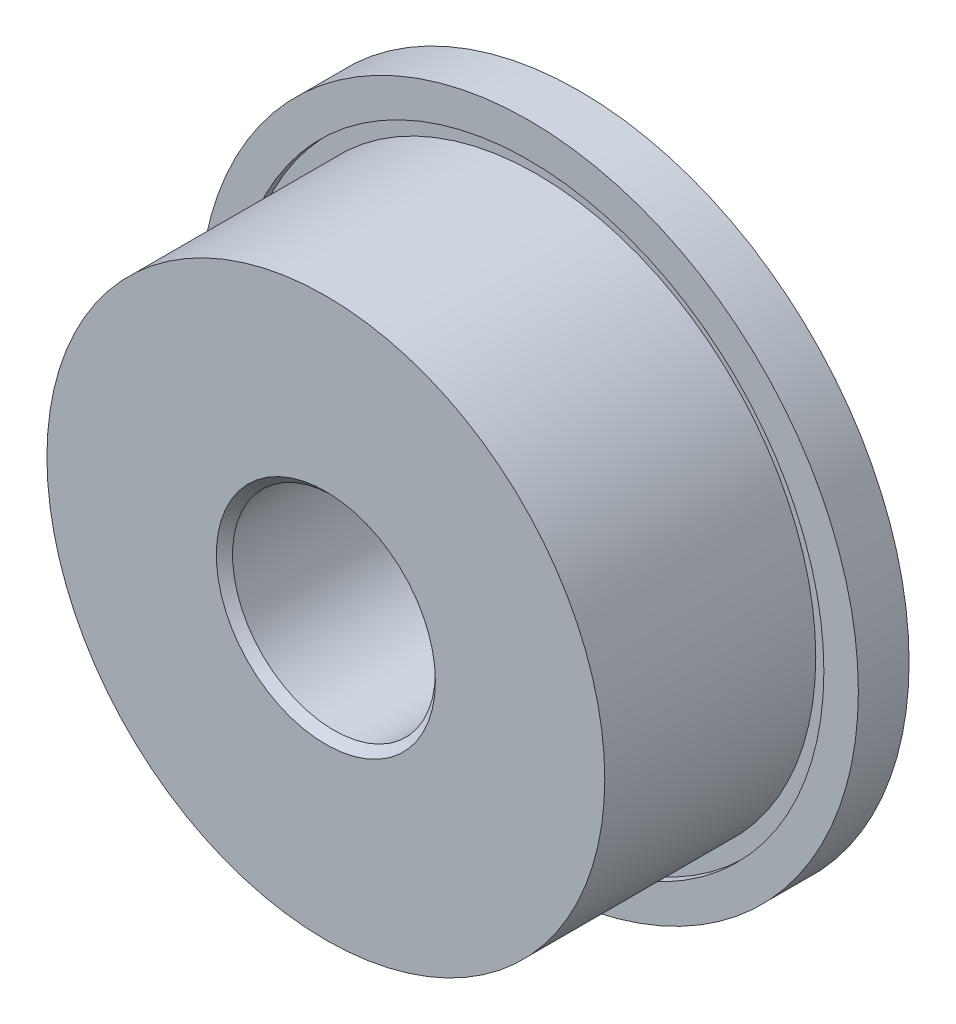
ISO-10303-21;
HEADER;
FILE_DESCRIPTION(('STEP AP214'),'2;1');
FILE_NAME('part.step','',(''),(''),'','','');
FILE_SCHEMA(('AUTOMOTIVE_DESIGN { 1 0 10303 214 1 1 1 1 }'));
ENDSEC;
DATA;
#1=APPLICATION_CONTEXT('core data for automotive mechanical design processes');
#2=APPLICATION_PROTOCOL_DEFINITION('international standard','automotive_design',2000,#1);
#3=PRODUCT_CONTEXT('',#1,'mechanical');
#4=PRODUCT('Part','Part','',(#3));
#5=PRODUCT_RELATED_PRODUCT_CATEGORY('part','',(#4));
#6=PRODUCT_DEFINITION_FORMATION('','',#4);
#7=PRODUCT_DEFINITION_CONTEXT('part definition',#1,'design');
#8=PRODUCT_DEFINITION('design','',#6,#7);
#9=PRODUCT_DEFINITION_SHAPE('','',#8);
#10=(LENGTH_UNIT() NAMED_UNIT(*) SI_UNIT(.MILLI.,.METRE.));
#11=(NAMED_UNIT(*) PLANE_ANGLE_UNIT() SI_UNIT($,.RADIAN.));
#12=(NAMED_UNIT(*) SI_UNIT($,.STERADIAN.) SOLID_ANGLE_UNIT());
#13=UNCERTAINTY_MEASURE_WITH_UNIT(LENGTH_MEASURE(1.E-05),#10,'distance_accuracy_value','');
#14=(GEOMETRIC_REPRESENTATION_CONTEXT(3) GLOBAL_UNCERTAINTY_ASSIGNED_CONTEXT((#13)) GLOBAL_UNIT_ASSIGNED_CONTEXT((#10,
#11,#12)) REPRESENTATION_CONTEXT('',''));
#15=CARTESIAN_POINT('',(0.,0.,0.));
#16=DIRECTION('',(0.,0.,1.));
#17=DIRECTION('',(1.,0.,0.));
#18=AXIS2_PLACEMENT_3D('',#15,#16,#17);
#19=CARTESIAN_POINT('',(0.,0.,1.5875));
#20=DIRECTION('',(0.,0.,-1.));
#21=DIRECTION('',(-1.,0.,0.));
#22=AXIS2_PLACEMENT_3D('',#19,#20,#21);
#23=CYLINDRICAL_SURFACE('',#22,10.31875);
#24=CARTESIAN_POINT('',(0.,0.,1.5875));
#25=DIRECTION('',(0.,0.,1.));
#26=DIRECTION('',(1.,0.,0.));
#27=AXIS2_PLACEMENT_3D('',#24,#25,#26);
#28=CIRCLE('',#27,10.31875);
#29=CARTESIAN_POINT('',(10.31875,0.,1.5875));
#30=VERTEX_POINT('',#29);
#31=EDGE_CURVE('E58',#30,#30,#28,.T.);
#32=ORIENTED_EDGE('',*,*,#31,.F.);
#33=EDGE_LOOP('',(#32));
#34=FACE_BOUND('',#33,.T.);
#35=CARTESIAN_POINT('',(0.,0.,0.));
#36=DIRECTION('',(0.,0.,1.));
#37=DIRECTION('',(1.,0.,0.));
#38=AXIS2_PLACEMENT_3D('',#35,#36,#37);
#39=CIRCLE('',#38,10.31875);
#40=CARTESIAN_POINT('',(10.31875,0.,0.));
#41=VERTEX_POINT('',#40);
#42=EDGE_CURVE('E59',#41,#41,#39,.T.);
#43=ORIENTED_EDGE('',*,*,#42,.T.);
#44=EDGE_LOOP('',(#43));
#45=FACE_BOUND('',#44,.T.);
#46=ADVANCED_FACE('F32',(#34,#45),#23,.T.);
#47=CARTESIAN_POINT('',(0.,0.,1.5875));
#48=DIRECTION('',(0.,0.,1.));
#49=DIRECTION('',(1.,0.,0.));
#50=AXIS2_PLACEMENT_3D('',#47,#48,#49);
#51=PLANE('',#50);
#52=CARTESIAN_POINT('',(0.,0.,1.5875));
#53=DIRECTION('',(0.,0.,1.));
#54=DIRECTION('',(1.,0.,0.));
#55=AXIS2_PLACEMENT_3D('',#52,#53,#54);
#56=CIRCLE('',#55,9.23925);
#57=CARTESIAN_POINT('',(9.23925,0.,1.5875));
#58=VERTEX_POINT('',#57);
#59=EDGE_CURVE('E80',#58,#58,#56,.T.);
#60=ORIENTED_EDGE('',*,*,#59,.F.);
#61=EDGE_LOOP('',(#60));
#62=FACE_BOUND('',#61,.T.);
#63=ORIENTED_EDGE('',*,*,#31,.T.);
#64=EDGE_LOOP('',(#63));
#65=FACE_BOUND('',#64,.T.);
#66=ADVANCED_FACE('F105',(#62,#65),#51,.T.);
#67=CARTESIAN_POINT('',(0.,0.,0.));
#68=DIRECTION('',(0.,0.,1.));
#69=DIRECTION('',(1.,0.,0.));
#70=AXIS2_PLACEMENT_3D('',#67,#68,#69);
#71=PLANE('',#70);
#72=CARTESIAN_POINT('',(0.,0.,0.));
#73=DIRECTION('',(0.,0.,1.));
#74=DIRECTION('',(1.,0.,0.));
#75=AXIS2_PLACEMENT_3D('',#72,#73,#74);
#76=CIRCLE('',#75,6.35);
#77=CARTESIAN_POINT('',(6.35,0.,0.));
#78=VERTEX_POINT('',#77);
#79=EDGE_CURVE('E55',#78,#78,#76,.F.);
#80=ORIENTED_EDGE('',*,*,#79,.F.);
#81=EDGE_LOOP('',(#80));
#82=FACE_BOUND('',#81,.T.);
#83=ORIENTED_EDGE('',*,*,#42,.F.);
#84=EDGE_LOOP('',(#83));
#85=FACE_BOUND('',#84,.T.);
#86=ADVANCED_FACE('F108',(#82,#85),#71,.F.);
#87=CARTESIAN_POINT('',(0.,0.,-1.5875));
#88=DIRECTION('',(0.,0.,1.));
#89=DIRECTION('',(1.,0.,0.));
#90=AXIS2_PLACEMENT_3D('',#87,#88,#89);
#91=CYLINDRICAL_SURFACE('',#90,6.35);
#92=CARTESIAN_POINT('',(0.,0.,-1.5875));
#93=DIRECTION('',(0.,0.,-1.));
#94=DIRECTION('',(-1.,0.,0.));
#95=AXIS2_PLACEMENT_3D('',#92,#93,#94);
#96=CIRCLE('',#95,6.35);
#97=CARTESIAN_POINT('',(-6.35,0.,-1.5875));
#98=VERTEX_POINT('',#97);
#99=EDGE_CURVE('E67',#98,#98,#96,.T.);
#100=ORIENTED_EDGE('',*,*,#99,.F.);
#101=EDGE_LOOP('',(#100));
#102=FACE_BOUND('',#101,.T.);
#103=ORIENTED_EDGE('',*,*,#79,.T.);
#104=EDGE_LOOP('',(#103));
#105=FACE_BOUND('',#104,.T.);
#106=ADVANCED_FACE('F118',(#102,#105),#91,.T.);
#107=CARTESIAN_POINT('',(0.,0.,-1.5875));
#108=DIRECTION('',(0.,0.,-1.));
#109=DIRECTION('',(-1.,0.,0.));
#110=AXIS2_PLACEMENT_3D('',#107,#108,#109);
#111=PLANE('',#110);
#112=CARTESIAN_POINT('',(0.,0.,-1.5875));
#113=DIRECTION('',(0.,0.,-1.));
#114=DIRECTION('',(-1.,0.,0.));
#115=AXIS2_PLACEMENT_3D('',#112,#113,#114);
#116=CIRCLE('',#115,4.7625);
#117=CARTESIAN_POINT('',(-4.7625,0.,-1.5875));
#118=VERTEX_POINT('',#117);
#119=EDGE_CURVE('E71',#118,#118,#116,.T.);
#120=ORIENTED_EDGE('',*,*,#119,.F.);
#121=EDGE_LOOP('',(#120));
#122=FACE_BOUND('',#121,.T.);
#123=ORIENTED_EDGE('',*,*,#99,.T.);
#124=EDGE_LOOP('',(#123));
#125=FACE_BOUND('',#124,.T.);
#126=ADVANCED_FACE('F124',(#122,#125),#111,.T.);
#127=CARTESIAN_POINT('',(0.,0.,-1.3335));
#128=DIRECTION('',(0.,0.,-1.));
#129=DIRECTION('',(-1.,0.,0.));
#130=AXIS2_PLACEMENT_3D('',#127,#128,#129);
#131=CYLINDRICAL_SURFACE('',#130,4.7625);
#132=CARTESIAN_POINT('',(0.,0.,-1.3335));
#133=DIRECTION('',(0.,0.,-1.));
#134=DIRECTION('',(-1.,0.,0.));
#135=AXIS2_PLACEMENT_3D('',#132,#133,#134);
#136=CIRCLE('',#135,4.7625);
#137=CARTESIAN_POINT('',(-4.7625,0.,-1.3335));
#138=VERTEX_POINT('',#137);
#139=EDGE_CURVE('E70',#138,#138,#136,.T.);
#140=ORIENTED_EDGE('',*,*,#139,.F.);
#141=EDGE_LOOP('',(#140));
#142=FACE_BOUND('',#141,.T.);
#143=ORIENTED_EDGE('',*,*,#119,.T.);
#144=EDGE_LOOP('',(#143));
#145=FACE_BOUND('',#144,.T.);
#146=ADVANCED_FACE('F151',(#142,#145),#131,.F.);
#147=CARTESIAN_POINT('',(0.,0.,-1.3335));
#148=DIRECTION('',(0.,0.,-1.));
#149=DIRECTION('',(-1.,0.,0.));
#150=AXIS2_PLACEMENT_3D('',#147,#148,#149);
#151=PLANE('',#150);
#152=CARTESIAN_POINT('',(0.,0.,-1.3335));
#153=DIRECTION('',(0.,0.,-1.));
#154=DIRECTION('',(-1.,0.,0.));
#155=AXIS2_PLACEMENT_3D('',#152,#153,#154);
#156=CIRCLE('',#155,3.96875);
#157=CARTESIAN_POINT('',(-3.96875,0.,-1.3335));
#158=VERTEX_POINT('',#157);
#159=EDGE_CURVE('E74',#158,#158,#156,.T.);
#160=ORIENTED_EDGE('',*,*,#159,.F.);
#161=EDGE_LOOP('',(#160));
#162=FACE_BOUND('',#161,.T.);
#163=ORIENTED_EDGE('',*,*,#139,.T.);
#164=EDGE_LOOP('',(#163));
#165=FACE_BOUND('',#164,.T.);
#166=ADVANCED_FACE('F145',(#162,#165),#151,.T.);
#167=CARTESIAN_POINT('',(0.,0.,-1.5875));
#168=DIRECTION('',(0.,0.,-1.));
#169=DIRECTION('',(-1.,0.,0.));
#170=AXIS2_PLACEMENT_3D('',#167,#168,#169);
#171=CIRCLE('',#170,3.71475000000001);
#172=CARTESIAN_POINT('',(-3.71475000000001,0.,-1.5875));
#173=VERTEX_POINT('',#172);
#174=EDGE_CURVE('E47',#173,#173,#171,.T.);
#175=ORIENTED_EDGE('',*,*,#174,.T.);
#176=EDGE_LOOP('',(#175));
#177=FACE_BOUND('',#176,.T.);
#178=CARTESIAN_POINT('',(0.,0.,-1.5875));
#179=DIRECTION('',(0.,0.,-1.));
#180=DIRECTION('',(-1.,0.,0.));
#181=AXIS2_PLACEMENT_3D('',#178,#179,#180);
#182=CIRCLE('',#181,3.42899999999998);
#183=CARTESIAN_POINT('',(-3.42899999999998,0.,-1.5875));
#184=VERTEX_POINT('',#183);
#185=EDGE_CURVE('E52',#184,#184,#182,.F.);
#186=ORIENTED_EDGE('',*,*,#185,.T.);
#187=EDGE_LOOP('',(#186));
#188=FACE_BOUND('',#187,.T.);
#189=ADVANCED_FACE('F101',(#177,#188),#111,.T.);
#190=CARTESIAN_POINT('',(0.,0.,1.3335));
#191=DIRECTION('',(0.,0.,1.));
#192=DIRECTION('',(1.,0.,0.));
#193=AXIS2_PLACEMENT_3D('',#190,#191,#192);
#194=CYLINDRICAL_SURFACE('',#193,9.23925);
#195=CARTESIAN_POINT('',(0.,0.,1.3335));
#196=DIRECTION('',(0.,0.,1.));
#197=DIRECTION('',(1.,0.,0.));
#198=AXIS2_PLACEMENT_3D('',#195,#196,#197);
#199=CIRCLE('',#198,9.23925);
#200=CARTESIAN_POINT('',(9.23925,0.,1.3335));
#201=VERTEX_POINT('',#200);
#202=EDGE_CURVE('E79',#201,#201,#199,.T.);
#203=ORIENTED_EDGE('',*,*,#202,.F.);
#204=EDGE_LOOP('',(#203));
#205=FACE_BOUND('',#204,.T.);
#206=ORIENTED_EDGE('',*,*,#59,.T.);
#207=EDGE_LOOP('',(#206));
#208=FACE_BOUND('',#207,.T.);
#209=ADVANCED_FACE('F95',(#205,#208),#194,.F.);
#210=CARTESIAN_POINT('',(0.,0.,1.3335));
#211=DIRECTION('',(0.,0.,1.));
#212=DIRECTION('',(1.,0.,0.));
#213=AXIS2_PLACEMENT_3D('',#210,#211,#212);
#214=PLANE('',#213);
#215=CARTESIAN_POINT('',(0.,0.,1.3335));
#216=DIRECTION('',(0.,0.,1.));
#217=DIRECTION('',(1.,0.,0.));
#218=AXIS2_PLACEMENT_3D('',#215,#216,#217);
#219=CIRCLE('',#218,8.73125);
#220=CARTESIAN_POINT('',(8.73125,0.,1.3335));
#221=VERTEX_POINT('',#220);
#222=EDGE_CURVE('E83',#221,#221,#219,.T.);
#223=ORIENTED_EDGE('',*,*,#222,.F.);
#224=EDGE_LOOP('',(#223));
#225=FACE_BOUND('',#224,.T.);
#226=ORIENTED_EDGE('',*,*,#202,.T.);
#227=EDGE_LOOP('',(#226));
#228=FACE_BOUND('',#227,.T.);
#229=ADVANCED_FACE('F91',(#225,#228),#214,.T.);
#230=CARTESIAN_POINT('',(0.,0.,7.9375));
#231=DIRECTION('',(0.,0.,1.));
#232=DIRECTION('',(1.,0.,0.));
#233=AXIS2_PLACEMENT_3D('',#230,#231,#232);
#234=PLANE('',#233);
#235=CARTESIAN_POINT('',(0.,0.,7.9375));
#236=DIRECTION('',(0.,0.,1.));
#237=DIRECTION('',(1.,0.,0.));
#238=AXIS2_PLACEMENT_3D('',#235,#236,#237);
#239=CIRCLE('',#238,3.42900000000001);
#240=CARTESIAN_POINT('',(3.42900000000001,0.,7.9375));
#241=VERTEX_POINT('',#240);
#242=EDGE_CURVE('E10',#241,#241,#239,.F.);
#243=ORIENTED_EDGE('',*,*,#242,.T.);
#244=EDGE_LOOP('',(#243));
#245=FACE_BOUND('',#244,.T.);
#246=CARTESIAN_POINT('',(0.,0.,7.9375));
#247=DIRECTION('',(0.,0.,1.));
#248=DIRECTION('',(1.,0.,0.));
#249=AXIS2_PLACEMENT_3D('',#246,#247,#248);
#250=CIRCLE('',#249,8.73125);
#251=CARTESIAN_POINT('',(8.73125,0.,7.9375));
#252=VERTEX_POINT('',#251);
#253=EDGE_CURVE('E62',#252,#252,#250,.T.);
#254=ORIENTED_EDGE('',*,*,#253,.T.);
#255=EDGE_LOOP('',(#254));
#256=FACE_BOUND('',#255,.T.);
#257=ADVANCED_FACE('F94',(#245,#256),#234,.T.);
#258=CARTESIAN_POINT('',(0.,0.,7.9375));
#259=DIRECTION('',(0.,0.,-1.));
#260=DIRECTION('',(-1.,0.,0.));
#261=AXIS2_PLACEMENT_3D('',#258,#259,#260);
#262=CYLINDRICAL_SURFACE('',#261,8.73125);
#263=ORIENTED_EDGE('',*,*,#253,.F.);
#264=EDGE_LOOP('',(#263));
#265=FACE_BOUND('',#264,.T.);
#266=ORIENTED_EDGE('',*,*,#222,.T.);
#267=EDGE_LOOP('',(#266));
#268=FACE_BOUND('',#267,.T.);
#269=ADVANCED_FACE('F89',(#265,#268),#262,.T.);
#270=CARTESIAN_POINT('',(0.,0.,-1.5875));
#271=DIRECTION('',(0.,0.,1.));
#272=DIRECTION('',(1.,0.,0.));
#273=AXIS2_PLACEMENT_3D('',#270,#271,#272);
#274=CYLINDRICAL_SURFACE('',#273,3.175);
#275=CARTESIAN_POINT('',(0.,0.,-1.33350000000002));
#276=DIRECTION('',(0.,0.,-1.));
#277=DIRECTION('',(-1.,0.,0.));
#278=AXIS2_PLACEMENT_3D('',#275,#276,#277);
#279=CIRCLE('',#278,3.175);
#280=CARTESIAN_POINT('',(3.175,0.,-1.33350000000002));
#281=VERTEX_POINT('',#280);
#282=EDGE_CURVE('E39',#281,#281,#279,.T.);
#283=CARTESIAN_POINT('',(0.,0.,7.68349999999999));
#284=DIRECTION('',(0.,0.,1.));
#285=DIRECTION('',(1.,0.,0.));
#286=AXIS2_PLACEMENT_3D('',#283,#284,#285);
#287=CIRCLE('',#286,3.175);
#288=CARTESIAN_POINT('',(3.175,0.,7.68349999999999));
#289=VERTEX_POINT('',#288);
#290=EDGE_CURVE('E43',#289,#289,#287,.T.);
#291=CARTESIAN_POINT('',(3.175,0.,-1.33350000000002));
#292=CARTESIAN_POINT('',(3.175,0.,-1.23957291666669));
#293=CARTESIAN_POINT('',(3.175,0.,-1.14564583333335));
#294=CARTESIAN_POINT('',(3.175,0.,-0.957791666666686));
#295=CARTESIAN_POINT('',(3.175,0.,-0.863864583333353));
#296=CARTESIAN_POINT('',(3.175,0.,-0.676010416666686));
#297=CARTESIAN_POINT('',(3.175,0.,-0.582083333333353));
#298=CARTESIAN_POINT('',(3.175,0.,-0.394229166666686));
#299=CARTESIAN_POINT('',(3.175,0.,-0.300302083333352));
#300=CARTESIAN_POINT('',(3.175,0.,-0.112447916666686));
#301=CARTESIAN_POINT('',(3.175,0.,-0.0185208333333521));
#302=CARTESIAN_POINT('',(3.175,0.,0.169333333333315));
#303=CARTESIAN_POINT('',(3.175,0.,0.263260416666648));
#304=CARTESIAN_POINT('',(3.175,0.,0.451114583333315));
#305=CARTESIAN_POINT('',(3.175,0.,0.545041666666648));
#306=CARTESIAN_POINT('',(3.175,0.,0.732895833333315));
#307=CARTESIAN_POINT('',(3.175,0.,0.826822916666648));
#308=CARTESIAN_POINT('',(3.175,0.,1.01467708333332));
#309=CARTESIAN_POINT('',(3.175,0.,1.10860416666665));
#310=CARTESIAN_POINT('',(3.175,0.,1.29645833333332));
#311=CARTESIAN_POINT('',(3.175,0.,1.39038541666665));
#312=CARTESIAN_POINT('',(3.175,0.,1.57823958333332));
#313=CARTESIAN_POINT('',(3.175,0.,1.67216666666665));
#314=CARTESIAN_POINT('',(3.175,0.,1.86002083333332));
#315=CARTESIAN_POINT('',(3.175,0.,1.95394791666665));
#316=CARTESIAN_POINT('',(3.175,0.,2.14180208333332));
#317=CARTESIAN_POINT('',(3.175,0.,2.23572916666665));
#318=CARTESIAN_POINT('',(3.175,0.,2.42358333333332));
#319=CARTESIAN_POINT('',(3.175,0.,2.51751041666665));
#320=CARTESIAN_POINT('',(3.175,0.,2.70536458333332));
#321=CARTESIAN_POINT('',(3.175,0.,2.79929166666665));
#322=CARTESIAN_POINT('',(3.175,0.,2.98714583333332));
#323=CARTESIAN_POINT('',(3.175,0.,3.08107291666665));
#324=CARTESIAN_POINT('',(3.175,0.,3.26892708333332));
#325=CARTESIAN_POINT('',(3.175,0.,3.36285416666665));
#326=CARTESIAN_POINT('',(3.175,0.,3.55070833333332));
#327=CARTESIAN_POINT('',(3.175,0.,3.64463541666665));
#328=CARTESIAN_POINT('',(3.175,0.,3.83248958333332));
#329=CARTESIAN_POINT('',(3.175,0.,3.92641666666665));
#330=CARTESIAN_POINT('',(3.175,0.,4.11427083333332));
#331=CARTESIAN_POINT('',(3.175,0.,4.20819791666665));
#332=CARTESIAN_POINT('',(3.175,0.,4.39605208333332));
#333=CARTESIAN_POINT('',(3.175,0.,4.48997916666665));
#334=CARTESIAN_POINT('',(3.175,0.,4.67783333333332));
#335=CARTESIAN_POINT('',(3.175,0.,4.77176041666665));
#336=CARTESIAN_POINT('',(3.175,0.,4.95961458333332));
#337=CARTESIAN_POINT('',(3.175,0.,5.05354166666665));
#338=CARTESIAN_POINT('',(3.175,0.,5.24139583333332));
#339=CARTESIAN_POINT('',(3.175,0.,5.33532291666665));
#340=CARTESIAN_POINT('',(3.175,0.,5.52317708333332));
#341=CARTESIAN_POINT('',(3.175,0.,5.61710416666665));
#342=CARTESIAN_POINT('',(3.175,0.,5.80495833333332));
#343=CARTESIAN_POINT('',(3.175,0.,5.89888541666665));
#344=CARTESIAN_POINT('',(3.175,0.,6.08673958333332));
#345=CARTESIAN_POINT('',(3.175,0.,6.18066666666665));
#346=CARTESIAN_POINT('',(3.175,0.,6.36852083333332));
#347=CARTESIAN_POINT('',(3.175,0.,6.46244791666665));
#348=CARTESIAN_POINT('',(3.175,0.,6.65030208333332));
#349=CARTESIAN_POINT('',(3.175,0.,6.74422916666665));
#350=CARTESIAN_POINT('',(3.175,0.,6.93208333333332));
#351=CARTESIAN_POINT('',(3.175,0.,7.02601041666665));
#352=CARTESIAN_POINT('',(3.175,0.,7.21386458333332));
#353=CARTESIAN_POINT('',(3.175,0.,7.30779166666665));
#354=CARTESIAN_POINT('',(3.175,0.,7.49564583333332));
#355=CARTESIAN_POINT('',(3.175,0.,7.58957291666665));
#356=CARTESIAN_POINT('',(3.175,0.,7.68349999999999));
#357=B_SPLINE_CURVE_WITH_KNOTS('',3,(#291,#292,#293,#294,#295,#296,#297,#298,#299,#300,#301,
#302,#303,#304,#305,#306,#307,#308,#309,#310,#311,#312,#313,#314,#315,#316,#317,#318,#319,#320,
#321,#322,#323,#324,#325,#326,#327,#328,#329,#330,#331,#332,#333,#334,#335,#336,#337,#338,#339,
#340,#341,#342,#343,#344,#345,#346,#347,#348,#349,#350,#351,#352,#353,#354,#355,#356),
.UNSPECIFIED.,.F.,.F.,(4,2,2,2,2,2,2,2,2,2,2,2,2,2,2,2,2,2,2,2,2,2,2,2,2,2,2,2,2,2,2,2,4),(0.,
0.28178125,0.5635625,0.845343750000001,1.127125,1.40890625,1.6906875,1.97246875,2.25425,
2.53603125,2.8178125,3.09959375,3.381375,3.66315625,3.9449375,4.22671875,4.5085,4.79028125,
5.0720625,5.35384375,5.635625,5.91740625,6.1991875,6.48096875000001,6.76275,7.04453125,
7.32631250000001,7.60809375,7.889875,8.17165625000001,8.45343750000001,8.73521875000001,
9.01700000000001),.UNSPECIFIED.);
#358=EDGE_CURVE('BSEAM133',#281,#289,#357,.T.);
#359=ORIENTED_EDGE('',*,*,#282,.T.);
#360=ORIENTED_EDGE('',*,*,#290,.T.);
#361=ORIENTED_EDGE('',*,*,#358,.T.);
#362=ORIENTED_EDGE('',*,*,#358,.F.);
#363=EDGE_LOOP('',(#359,#361,#360,#362));
#364=FACE_BOUND('',#363,.T.);
#365=ADVANCED_FACE('F133',(#364),#274,.F.);
#366=CARTESIAN_POINT('',(0.,0.,-1.5875));
#367=DIRECTION('',(0.,0.,1.));
#368=DIRECTION('',(1.,0.,0.));
#369=AXIS2_PLACEMENT_3D('',#366,#367,#368);
#370=CONICAL_SURFACE('',#369,3.71475000000001,0.785398163397442);
#371=ORIENTED_EDGE('',*,*,#159,.T.);
#372=EDGE_LOOP('',(#371));
#373=FACE_BOUND('',#372,.T.);
#374=ORIENTED_EDGE('',*,*,#174,.F.);
#375=EDGE_LOOP('',(#374));
#376=FACE_BOUND('',#375,.T.);
#377=ADVANCED_FACE('F130',(#373,#376),#370,.T.);
#378=CARTESIAN_POINT('',(0.,0.,-1.5875));
#379=DIRECTION('',(0.,0.,-1.));
#380=DIRECTION('',(-1.,0.,0.));
#381=AXIS2_PLACEMENT_3D('',#378,#379,#380);
#382=CONICAL_SURFACE('',#381,3.42899999999998,0.785398163397449);
#383=ORIENTED_EDGE('',*,*,#282,.F.);
#384=EDGE_LOOP('',(#383));
#385=FACE_BOUND('',#384,.T.);
#386=ORIENTED_EDGE('',*,*,#185,.F.);
#387=EDGE_LOOP('',(#386));
#388=FACE_BOUND('',#387,.T.);
#389=ADVANCED_FACE('F132',(#385,#388),#382,.F.);
#390=CARTESIAN_POINT('',(0.,0.,7.68349999999999));
#391=DIRECTION('',(0.,0.,1.));
#392=DIRECTION('',(1.,0.,0.));
#393=AXIS2_PLACEMENT_3D('',#390,#391,#392);
#394=CONICAL_SURFACE('',#393,3.175,0.785398163397453);
#395=ORIENTED_EDGE('',*,*,#242,.F.);
#396=EDGE_LOOP('',(#395));
#397=FACE_BOUND('',#396,.T.);
#398=ORIENTED_EDGE('',*,*,#290,.F.);
#399=EDGE_LOOP('',(#398));
#400=FACE_BOUND('',#399,.T.);
#401=ADVANCED_FACE('F34',(#397,#400),#394,.F.);
#402=CLOSED_SHELL('',(#46,#66,#86,#106,#126,#146,#166,#189,#209,#229,#257,#269,#365,#377,#389,#401));
#403=MANIFOLD_SOLID_BREP('B2',#402);
#404=ADVANCED_BREP_SHAPE_REPRESENTATION('',(#18,#403),#14);
#405=SHAPE_DEFINITION_REPRESENTATION(#9,#404);
ENDSEC;
END-ISO-10303-21;
